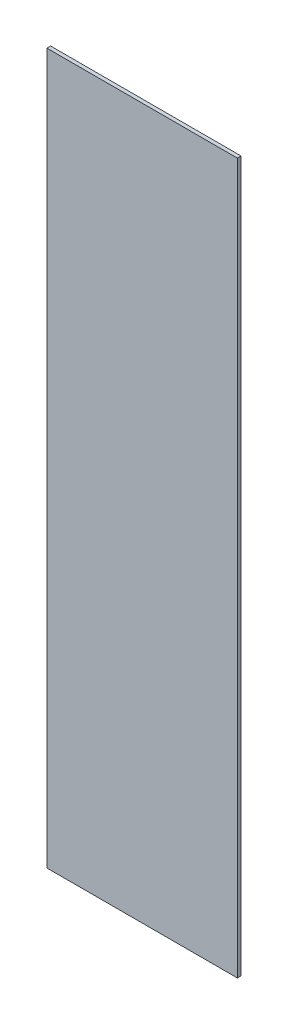
ISO-10303-21;
HEADER;
FILE_DESCRIPTION(('STEP AP214'),'2;1');
FILE_NAME('part.step','',(''),(''),'','','');
FILE_SCHEMA(('AUTOMOTIVE_DESIGN { 1 0 10303 214 1 1 1 1 }'));
ENDSEC;
DATA;
#1=APPLICATION_CONTEXT('core data for automotive mechanical design processes');
#2=APPLICATION_PROTOCOL_DEFINITION('international standard','automotive_design',2000,#1);
#3=PRODUCT_CONTEXT('',#1,'mechanical');
#4=PRODUCT('Part','Part','',(#3));
#5=PRODUCT_RELATED_PRODUCT_CATEGORY('part','',(#4));
#6=PRODUCT_DEFINITION_FORMATION('','',#4);
#7=PRODUCT_DEFINITION_CONTEXT('part definition',#1,'design');
#8=PRODUCT_DEFINITION('design','',#6,#7);
#9=PRODUCT_DEFINITION_SHAPE('','',#8);
#10=(LENGTH_UNIT() NAMED_UNIT(*) SI_UNIT(.MILLI.,.METRE.));
#11=(NAMED_UNIT(*) PLANE_ANGLE_UNIT() SI_UNIT($,.RADIAN.));
#12=(NAMED_UNIT(*) SI_UNIT($,.STERADIAN.) SOLID_ANGLE_UNIT());
#13=UNCERTAINTY_MEASURE_WITH_UNIT(LENGTH_MEASURE(1.E-05),#10,'distance_accuracy_value','');
#14=(GEOMETRIC_REPRESENTATION_CONTEXT(3) GLOBAL_UNCERTAINTY_ASSIGNED_CONTEXT((#13)) GLOBAL_UNIT_ASSIGNED_CONTEXT((#10,
#11,#12)) REPRESENTATION_CONTEXT('',''));
#15=CARTESIAN_POINT('',(0.,0.,0.));
#16=DIRECTION('',(0.,0.,1.));
#17=DIRECTION('',(1.,0.,0.));
#18=AXIS2_PLACEMENT_3D('',#15,#16,#17);
#19=CARTESIAN_POINT('',(378.581094864544,-1809.24068779773,6.35));
#20=DIRECTION('',(1.,0.,0.));
#21=DIRECTION('',(0.,0.,-1.));
#22=AXIS2_PLACEMENT_3D('',#19,#20,#21);
#23=PLANE('',#22);
#24=DIRECTION('',(0.,-1.,0.));
#25=VECTOR('',#24,1.);
#26=CARTESIAN_POINT('',(378.581094864544,-1809.24068779773,0.));
#27=LINE('',#26,#25);
#28=CARTESIAN_POINT('',(378.581094864544,-590.040687797731,0.));
#29=VERTEX_POINT('',#28);
#30=CARTESIAN_POINT('',(378.581094864544,-1809.24068779773,0.));
#31=VERTEX_POINT('',#30);
#32=EDGE_CURVE('E99',#29,#31,#27,.T.);
#33=ORIENTED_EDGE('',*,*,#32,.T.);
#34=DIRECTION('',(0.,0.,-1.));
#35=VECTOR('',#34,1.);
#36=CARTESIAN_POINT('',(378.581094864544,-1809.24068779773,6.35));
#37=LINE('',#36,#35);
#38=CARTESIAN_POINT('',(378.581094864544,-1809.24068779773,6.35));
#39=VERTEX_POINT('',#38);
#40=EDGE_CURVE('E11',#39,#31,#37,.T.);
#41=ORIENTED_EDGE('',*,*,#40,.F.);
#42=DIRECTION('',(0.,-1.,0.));
#43=VECTOR('',#42,1.);
#44=CARTESIAN_POINT('',(378.581094864544,-1809.24068779773,6.35));
#45=LINE('',#44,#43);
#46=CARTESIAN_POINT('',(378.581094864544,-590.040687797731,6.35));
#47=VERTEX_POINT('',#46);
#48=EDGE_CURVE('E87',#47,#39,#45,.T.);
#49=ORIENTED_EDGE('',*,*,#48,.F.);
#50=DIRECTION('',(0.,0.,-1.));
#51=VECTOR('',#50,1.);
#52=CARTESIAN_POINT('',(378.581094864544,-590.040687797731,6.35));
#53=LINE('',#52,#51);
#54=EDGE_CURVE('E95',#47,#29,#53,.T.);
#55=ORIENTED_EDGE('',*,*,#54,.T.);
#56=EDGE_LOOP('',(#33,#41,#49,#55));
#57=FACE_BOUND('',#56,.T.);
#58=ADVANCED_FACE('F36',(#57),#23,.F.);
#59=CARTESIAN_POINT('',(378.581094864544,-1809.24068779773,6.35));
#60=DIRECTION('',(0.,1.,0.));
#61=DIRECTION('',(0.,0.,1.));
#62=AXIS2_PLACEMENT_3D('',#59,#60,#61);
#63=PLANE('',#62);
#64=DIRECTION('',(1.,0.,0.));
#65=VECTOR('',#64,1.);
#66=CARTESIAN_POINT('',(378.581094864544,-1809.24068779773,0.));
#67=LINE('',#66,#65);
#68=CARTESIAN_POINT('',(705.606094864544,-1809.24068779773,0.));
#69=VERTEX_POINT('',#68);
#70=EDGE_CURVE('E91',#31,#69,#67,.T.);
#71=ORIENTED_EDGE('',*,*,#70,.T.);
#72=DIRECTION('',(0.,0.,-1.));
#73=VECTOR('',#72,1.);
#74=CARTESIAN_POINT('',(705.606094864544,-1809.24068779773,6.35));
#75=LINE('',#74,#73);
#76=CARTESIAN_POINT('',(705.606094864544,-1809.24068779773,6.35));
#77=VERTEX_POINT('',#76);
#78=EDGE_CURVE('E44',#77,#69,#75,.T.);
#79=ORIENTED_EDGE('',*,*,#78,.F.);
#80=DIRECTION('',(1.,0.,0.));
#81=VECTOR('',#80,1.);
#82=CARTESIAN_POINT('',(378.581094864544,-1809.24068779773,6.35));
#83=LINE('',#82,#81);
#84=EDGE_CURVE('E82',#39,#77,#83,.T.);
#85=ORIENTED_EDGE('',*,*,#84,.F.);
#86=ORIENTED_EDGE('',*,*,#40,.T.);
#87=EDGE_LOOP('',(#71,#79,#85,#86));
#88=FACE_BOUND('',#87,.T.);
#89=ADVANCED_FACE('F90',(#88),#63,.F.);
#90=CARTESIAN_POINT('',(705.606094864544,-1809.24068779773,6.35));
#91=DIRECTION('',(-1.,0.,0.));
#92=DIRECTION('',(0.,-1.,0.));
#93=AXIS2_PLACEMENT_3D('',#90,#91,#92);
#94=PLANE('',#93);
#95=DIRECTION('',(0.,1.,0.));
#96=VECTOR('',#95,1.);
#97=CARTESIAN_POINT('',(705.606094864544,-1809.24068779773,0.));
#98=LINE('',#97,#96);
#99=CARTESIAN_POINT('',(705.606094864544,-590.040687797731,0.));
#100=VERTEX_POINT('',#99);
#101=EDGE_CURVE('E69',#69,#100,#98,.T.);
#102=ORIENTED_EDGE('',*,*,#101,.T.);
#103=DIRECTION('',(0.,0.,-1.));
#104=VECTOR('',#103,1.);
#105=CARTESIAN_POINT('',(705.606094864544,-590.040687797731,6.35));
#106=LINE('',#105,#104);
#107=CARTESIAN_POINT('',(705.606094864544,-590.040687797731,6.35));
#108=VERTEX_POINT('',#107);
#109=EDGE_CURVE('E92',#108,#100,#106,.T.);
#110=ORIENTED_EDGE('',*,*,#109,.F.);
#111=DIRECTION('',(0.,1.,0.));
#112=VECTOR('',#111,1.);
#113=CARTESIAN_POINT('',(705.606094864544,-1809.24068779773,6.35));
#114=LINE('',#113,#112);
#115=EDGE_CURVE('E85',#77,#108,#114,.T.);
#116=ORIENTED_EDGE('',*,*,#115,.F.);
#117=ORIENTED_EDGE('',*,*,#78,.T.);
#118=EDGE_LOOP('',(#102,#110,#116,#117));
#119=FACE_BOUND('',#118,.T.);
#120=ADVANCED_FACE('F93',(#119),#94,.F.);
#121=CARTESIAN_POINT('',(378.581094864544,-590.040687797731,6.35));
#122=DIRECTION('',(0.,-1.,0.));
#123=DIRECTION('',(0.,0.,-1.));
#124=AXIS2_PLACEMENT_3D('',#121,#122,#123);
#125=PLANE('',#124);
#126=DIRECTION('',(-1.,0.,0.));
#127=VECTOR('',#126,1.);
#128=CARTESIAN_POINT('',(378.581094864544,-590.040687797731,0.));
#129=LINE('',#128,#127);
#130=EDGE_CURVE('E75',#100,#29,#129,.T.);
#131=ORIENTED_EDGE('',*,*,#130,.T.);
#132=ORIENTED_EDGE('',*,*,#54,.F.);
#133=DIRECTION('',(-1.,0.,0.));
#134=VECTOR('',#133,1.);
#135=CARTESIAN_POINT('',(378.581094864544,-590.040687797731,6.35));
#136=LINE('',#135,#134);
#137=EDGE_CURVE('E52',#108,#47,#136,.T.);
#138=ORIENTED_EDGE('',*,*,#137,.F.);
#139=ORIENTED_EDGE('',*,*,#109,.T.);
#140=EDGE_LOOP('',(#131,#132,#138,#139));
#141=FACE_BOUND('',#140,.T.);
#142=ADVANCED_FACE('F106',(#141),#125,.F.);
#143=CARTESIAN_POINT('',(0.,0.,6.35));
#144=DIRECTION('',(0.,0.,-1.));
#145=DIRECTION('',(-1.,0.,0.));
#146=AXIS2_PLACEMENT_3D('',#143,#144,#145);
#147=PLANE('',#146);
#148=ORIENTED_EDGE('',*,*,#48,.T.);
#149=ORIENTED_EDGE('',*,*,#84,.T.);
#150=ORIENTED_EDGE('',*,*,#115,.T.);
#151=ORIENTED_EDGE('',*,*,#137,.T.);
#152=EDGE_LOOP('',(#148,#149,#150,#151));
#153=FACE_BOUND('',#152,.T.);
#154=ADVANCED_FACE('F83',(#153),#147,.F.);
#155=CARTESIAN_POINT('',(0.,0.,0.));
#156=DIRECTION('',(0.,0.,-1.));
#157=DIRECTION('',(-1.,0.,0.));
#158=AXIS2_PLACEMENT_3D('',#155,#156,#157);
#159=PLANE('',#158);
#160=ORIENTED_EDGE('',*,*,#32,.F.);
#161=ORIENTED_EDGE('',*,*,#130,.F.);
#162=ORIENTED_EDGE('',*,*,#101,.F.);
#163=ORIENTED_EDGE('',*,*,#70,.F.);
#164=EDGE_LOOP('',(#160,#161,#162,#163));
#165=FACE_BOUND('',#164,.T.);
#166=ADVANCED_FACE('F109',(#165),#159,.T.);
#167=CLOSED_SHELL('',(#58,#89,#120,#142,#154,#166));
#168=MANIFOLD_SOLID_BREP('B2',#167);
#169=ADVANCED_BREP_SHAPE_REPRESENTATION('',(#18,#168),#14);
#170=SHAPE_DEFINITION_REPRESENTATION(#9,#169);
ENDSEC;
END-ISO-10303-21;
